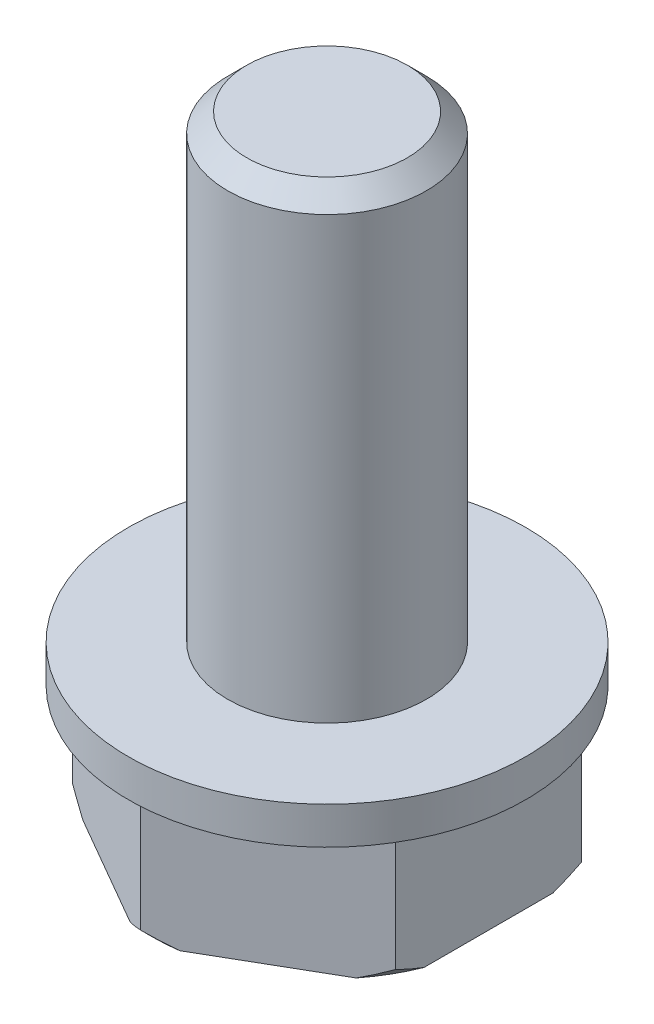
ISO-10303-21;
HEADER;
FILE_DESCRIPTION(('STEP AP214'),'2;1');
FILE_NAME('part.step','',(''),(''),'','','');
FILE_SCHEMA(('AUTOMOTIVE_DESIGN { 1 0 10303 214 1 1 1 1 }'));
ENDSEC;
DATA;
#1=APPLICATION_CONTEXT('core data for automotive mechanical design processes');
#2=APPLICATION_PROTOCOL_DEFINITION('international standard','automotive_design',2000,#1);
#3=PRODUCT_CONTEXT('',#1,'mechanical');
#4=PRODUCT('Part','Part','',(#3));
#5=PRODUCT_RELATED_PRODUCT_CATEGORY('part','',(#4));
#6=PRODUCT_DEFINITION_FORMATION('','',#4);
#7=PRODUCT_DEFINITION_CONTEXT('part definition',#1,'design');
#8=PRODUCT_DEFINITION('design','',#6,#7);
#9=PRODUCT_DEFINITION_SHAPE('','',#8);
#10=(LENGTH_UNIT() NAMED_UNIT(*) SI_UNIT(.MILLI.,.METRE.));
#11=(NAMED_UNIT(*) PLANE_ANGLE_UNIT() SI_UNIT($,.RADIAN.));
#12=(NAMED_UNIT(*) SI_UNIT($,.STERADIAN.) SOLID_ANGLE_UNIT());
#13=UNCERTAINTY_MEASURE_WITH_UNIT(LENGTH_MEASURE(1.E-05),#10,'distance_accuracy_value','');
#14=(GEOMETRIC_REPRESENTATION_CONTEXT(3) GLOBAL_UNCERTAINTY_ASSIGNED_CONTEXT((#13)) GLOBAL_UNIT_ASSIGNED_CONTEXT((#10,
#11,#12)) REPRESENTATION_CONTEXT('',''));
#15=CARTESIAN_POINT('',(0.,0.,0.));
#16=DIRECTION('',(0.,0.,1.));
#17=DIRECTION('',(1.,0.,0.));
#18=AXIS2_PLACEMENT_3D('',#15,#16,#17);
#19=CARTESIAN_POINT('',(-18.2487373415292,113.4,20.9959605917966));
#20=DIRECTION('',(-0.5,0.,0.866025403784439));
#21=DIRECTION('',(0.866025403784439,0.,0.5));
#22=AXIS2_PLACEMENT_3D('',#19,#20,#21);
#23=PLANE('',#22);
#24=DIRECTION('',(0.,-1.,0.));
#25=VECTOR('',#24,1.);
#26=CARTESIAN_POINT('',(-18.2487373415292,113.4,20.9959605917966));
#27=LINE('',#26,#25);
#28=CARTESIAN_POINT('',(-18.2487373415292,68.7,20.9959605917966));
#29=VERTEX_POINT('',#28);
#30=CARTESIAN_POINT('',(-18.2487373415292,63.9055534994651,20.9959605917966));
#31=VERTEX_POINT('',#30);
#32=EDGE_CURVE('E11',#29,#31,#27,.T.);
#33=ORIENTED_EDGE('',*,*,#32,.T.);
#34=CARTESIAN_POINT('',(-19.2487373415292,63.4,20.418610322607));
#35=CARTESIAN_POINT('',(-19.2075875044048,63.4176356350764,20.4423683487996));
#36=CARTESIAN_POINT('',(-19.1665561132061,63.4356367332046,20.466059223998));
#37=CARTESIAN_POINT('',(-19.0843485750121,63.4725093452912,20.5135255035906));
#38=CARTESIAN_POINT('',(-19.0431746303517,63.491387396993,20.5372996452214));
#39=CARTESIAN_POINT('',(-18.9606612245202,63.5300136187559,20.58494289067));
#40=CARTESIAN_POINT('',(-18.9193241287219,63.5497685285904,20.6088106227115));
#41=CARTESIAN_POINT('',(-18.8364645459509,63.5901483001101,20.6566518801523));
#42=CARTESIAN_POINT('',(-18.7949445731156,63.6107800529027,20.6806239409595));
#43=CARTESIAN_POINT('',(-18.7117004687104,63.6529133663717,20.7286845680958));
#44=CARTESIAN_POINT('',(-18.6699789875042,63.6744219220571,20.7527715894061));
#45=CARTESIAN_POINT('',(-18.5863140898282,63.7183087773034,20.8010727907276));
#46=CARTESIAN_POINT('',(-18.5443734460972,63.7406941334488,20.8252853590476));
#47=CARTESIAN_POINT('',(-18.4602534517763,63.7863344571394,20.8738481173586));
#48=CARTESIAN_POINT('',(-18.4180769827817,63.8095965033679,20.8981966416392));
#49=CARTESIAN_POINT('',(-18.3334693927313,63.8569905234084,20.9470416600006));
#50=CARTESIAN_POINT('',(-18.2910412469439,63.8811295690813,20.9715364479081));
#51=CARTESIAN_POINT('',(-18.2487373415292,63.9055534994651,20.9959605917966));
#52=B_SPLINE_CURVE_WITH_KNOTS('',3,(#34,#35,#36,#37,#38,#39,#40,#41,#42,#43,#44,#45,#46,#47,#48,
#49,#50,#51),.UNSPECIFIED.,.F.,.F.,(4,2,2,2,2,2,2,2,4),(0.,0.15204686609259,0.305507708751331,
0.460480357340248,0.617058082843109,0.775329645183755,0.93537936156832,1.0972871929665,
1.26112884592903),.UNSPECIFIED.);
#53=CARTESIAN_POINT('',(-19.2487373415291,63.4,20.4186103226069));
#54=VERTEX_POINT('',#53);
#55=EDGE_CURVE('E259',#54,#31,#52,.T.);
#56=ORIENTED_EDGE('',*,*,#55,.F.);
#57=DIRECTION('',(0.866025403784439,0.,0.5));
#58=VECTOR('',#57,1.);
#59=CARTESIAN_POINT('',(-16.2487373415291,63.4,22.1506611301759));
#60=LINE('',#59,#58);
#61=CARTESIAN_POINT('',(-23.7487373415292,63.4,17.8205341112537));
#62=VERTEX_POINT('',#61);
#63=EDGE_CURVE('E382',#62,#54,#60,.T.);
#64=ORIENTED_EDGE('',*,*,#63,.F.);
#65=CARTESIAN_POINT('',(-24.7487373415292,63.9055534994651,17.243183842064));
#66=CARTESIAN_POINT('',(-24.7064334597487,63.8811295690813,17.2676080268882));
#67=CARTESIAN_POINT('',(-24.6640062782667,63.8569905234084,17.2921044850218));
#68=CARTESIAN_POINT('',(-24.5794014564922,63.8095965033679,17.3409542981778));
#69=CARTESIAN_POINT('',(-24.5372267814232,63.7863344571393,17.3653059296287));
#70=CARTESIAN_POINT('',(-24.4531102018877,63.7406941334488,17.4138746025213));
#71=CARTESIAN_POINT('',(-24.4111711807661,63.7183087773034,17.4380899812835));
#72=CARTESIAN_POINT('',(-24.3275086645504,63.6744219220571,17.4863953074152));
#73=CARTESIAN_POINT('',(-24.2857879515911,63.6529133663717,17.5104836593681));
#74=CARTESIAN_POINT('',(-24.2025441753667,63.6107800529027,17.5585448549301));
#75=CARTESIAN_POINT('',(-24.1610237753089,63.5901483001101,17.5825161757663));
#76=CARTESIAN_POINT('',(-24.0781622396307,63.5497685285904,17.6303540506726));
#77=CARTESIAN_POINT('',(-24.0368236294529,63.5300136187559,17.6542191597318));
#78=CARTESIAN_POINT('',(-23.9543066656599,63.4913873969929,17.7018562426104));
#79=CARTESIAN_POINT('',(-23.9131306827243,63.4725093452912,17.7256268538449));
#80=CARTESIAN_POINT('',(-23.830919909677,63.4356367332046,17.7730875305072));
#81=CARTESIAN_POINT('',(-23.7898873143179,63.4176356350764,17.7967763200387));
#82=CARTESIAN_POINT('',(-23.7487373415292,63.4,17.8205341112537));
#83=B_SPLINE_CURVE_WITH_KNOTS('',3,(#65,#66,#67,#68,#69,#70,#71,#72,#73,#74,#75,#76,#77,#78,#79,
#80,#81,#82),.UNSPECIFIED.,.F.,.F.,(4,2,2,2,2,2,2,2,4),(0.,0.163841652962563,0.32574948436077,
0.485799200745345,0.644070763085999,0.800648488588859,0.955621137177762,1.10908197983649,
1.26112884592904),.UNSPECIFIED.);
#84=CARTESIAN_POINT('',(-24.7487373415292,63.9055534994651,17.243183842064));
#85=VERTEX_POINT('',#84);
#86=EDGE_CURVE('E122',#85,#62,#83,.T.);
#87=ORIENTED_EDGE('',*,*,#86,.F.);
#88=DIRECTION('',(0.,-1.,0.));
#89=VECTOR('',#88,1.);
#90=CARTESIAN_POINT('',(-24.7487373415292,113.4,17.243183842064));
#91=LINE('',#90,#89);
#92=CARTESIAN_POINT('',(-24.7487373415292,68.7,17.243183842064));
#93=VERTEX_POINT('',#92);
#94=EDGE_CURVE('E116',#93,#85,#91,.T.);
#95=ORIENTED_EDGE('',*,*,#94,.F.);
#96=DIRECTION('',(-0.866025403784439,0.,-0.5));
#97=VECTOR('',#96,1.);
#98=CARTESIAN_POINT('',(-18.4987373415292,68.7,20.8516230244992));
#99=LINE('',#98,#97);
#100=EDGE_CURVE('E119',#29,#93,#99,.T.);
#101=ORIENTED_EDGE('',*,*,#100,.F.);
#102=EDGE_LOOP('',(#33,#56,#64,#87,#95,#101));
#103=FACE_BOUND('',#102,.T.);
#104=ADVANCED_FACE('F16',(#103),#23,.F.);
#105=CARTESIAN_POINT('',(-18.2487373415292,113.4,28.5015140912618));
#106=DIRECTION('',(-1.,0.,0.));
#107=DIRECTION('',(0.,0.,1.));
#108=AXIS2_PLACEMENT_3D('',#105,#106,#107);
#109=PLANE('',#108);
#110=DIRECTION('',(0.,-1.,0.));
#111=VECTOR('',#110,1.);
#112=CARTESIAN_POINT('',(-18.2487373415292,113.4,28.5015140912618));
#113=LINE('',#112,#111);
#114=CARTESIAN_POINT('',(-18.2487373415292,68.7,28.5015140912618));
#115=VERTEX_POINT('',#114);
#116=CARTESIAN_POINT('',(-18.2487373415292,63.9055534994651,28.5015140912618));
#117=VERTEX_POINT('',#116);
#118=EDGE_CURVE('E156',#115,#117,#113,.T.);
#119=ORIENTED_EDGE('',*,*,#118,.T.);
#120=CARTESIAN_POINT('',(-18.2487373415292,63.4,27.3468135528825));
#121=CARTESIAN_POINT('',(-18.2487374771936,63.4176356350764,27.39432937029));
#122=CARTESIAN_POINT('',(-18.248738681354,63.4356367332046,27.4417090350199));
#123=CARTESIAN_POINT('',(-18.2487419162073,63.4725093452912,27.5366359912749));
#124=CARTESIAN_POINT('',(-18.2487439544825,63.4913873969929,27.5841807441401));
#125=CARTESIAN_POINT('',(-18.2487475124439,63.5300136187559,27.6794610724673));
#126=CARTESIAN_POINT('',(-18.2487490268234,63.5497685285904,27.727193913568));
#127=CARTESIAN_POINT('',(-18.2487509797307,63.5901483001101,27.8228730459151));
#128=CARTESIAN_POINT('',(-18.2487514069532,63.6107800529027,27.8708164275585));
#129=CARTESIAN_POINT('',(-18.2487510787723,63.6529133663717,27.9669382502568));
#130=CARTESIAN_POINT('',(-18.2487503105256,63.674421922057,28.01511362352));
#131=CARTESIAN_POINT('',(-18.2487479290653,63.7183087773034,28.1117201509732));
#132=CARTESIAN_POINT('',(-18.2487463064557,63.7406941334488,28.1601480980554));
#133=CARTESIAN_POINT('',(-18.2487428916704,63.7863344571393,28.2572795292589));
#134=CARTESIAN_POINT('',(-18.2487410977448,63.8095965033679,28.3059796849905));
#135=CARTESIAN_POINT('',(-18.2487383294689,63.8569905234084,28.4036745165079));
#136=CARTESIAN_POINT('',(-18.2487373651634,63.8811295690813,28.452665762549));
#137=CARTESIAN_POINT('',(-18.2487373415292,63.9055534994651,28.5015140912617));
#138=B_SPLINE_CURVE_WITH_KNOTS('',3,(#120,#121,#122,#123,#124,#125,#126,#127,#128,#129,#130,
#131,#132,#133,#134,#135,#136,#137),.UNSPECIFIED.,.F.,.F.,(4,2,2,2,2,2,2,2,4),(0.,
0.152046866092561,0.305507708751281,0.460480357340183,0.617058082843045,0.775329645183697,
0.935379361568268,1.09728719296647,1.26112884592903),.UNSPECIFIED.);
#139=CARTESIAN_POINT('',(-18.2487373415292,63.4,27.3468135528825));
#140=VERTEX_POINT('',#139);
#141=EDGE_CURVE('E29',#140,#117,#138,.T.);
#142=ORIENTED_EDGE('',*,*,#141,.F.);
#143=DIRECTION('',(0.,0.,1.));
#144=VECTOR('',#143,1.);
#145=CARTESIAN_POINT('',(-18.2487373415292,63.4,24.7487373415292));
#146=LINE('',#145,#144);
#147=CARTESIAN_POINT('',(-18.2487373415292,63.4,22.1506611301759));
#148=VERTEX_POINT('',#147);
#149=EDGE_CURVE('E244',#148,#140,#146,.T.);
#150=ORIENTED_EDGE('',*,*,#149,.F.);
#151=CARTESIAN_POINT('',(-18.2487373415292,63.9055534994651,20.9959605917966));
#152=CARTESIAN_POINT('',(-18.2487373415292,63.7175987189877,21.3718701527514));
#153=CARTESIAN_POINT('',(-18.2487373415292,63.5456736196058,21.7581725138741));
#154=CARTESIAN_POINT('',(-18.2487373415292,63.4,22.1506611301759));
#155=(BOUNDED_CURVE() B_SPLINE_CURVE(3,(#151,#152,#153,#154),.UNSPECIFIED.,.F.,
.F.) B_SPLINE_CURVE_WITH_KNOTS((4,4),(0.00544471025563386,0.00669711306648936),
.UNSPECIFIED.) CURVE() GEOMETRIC_REPRESENTATION_ITEM() RATIONAL_B_SPLINE_CURVE((1.,1.,1.,1.)) REPRESENTATION_ITEM(''));
#156=EDGE_CURVE('E495',#31,#148,#155,.T.);
#157=ORIENTED_EDGE('',*,*,#156,.F.);
#158=ORIENTED_EDGE('',*,*,#32,.F.);
#159=DIRECTION('',(0.,0.,-1.));
#160=VECTOR('',#159,1.);
#161=CARTESIAN_POINT('',(-18.2487373415292,68.7,24.7487373415292));
#162=LINE('',#161,#160);
#163=EDGE_CURVE('E140',#115,#29,#162,.T.);
#164=ORIENTED_EDGE('',*,*,#163,.F.);
#165=EDGE_LOOP('',(#119,#142,#150,#157,#158,#164));
#166=FACE_BOUND('',#165,.T.);
#167=ADVANCED_FACE('F185',(#166),#109,.F.);
#168=CARTESIAN_POINT('',(-24.7487373415292,64.2,24.7487373415292));
#169=DIRECTION('',(0.,1.,0.));
#170=DIRECTION('',(0.,0.,1.));
#171=AXIS2_PLACEMENT_3D('',#168,#169,#170);
#172=CONICAL_SURFACE('',#171,7.8,0.785398163397448);
#173=CARTESIAN_POINT('',(-24.7487373415292,63.4,24.7487373415292));
#174=DIRECTION('',(0.,-1.,0.));
#175=DIRECTION('',(0.,0.,-1.));
#176=AXIS2_PLACEMENT_3D('',#173,#174,#175);
#177=CIRCLE('',#176,7.);
#178=CARTESIAN_POINT('',(-19.2487373415291,63.4,29.0788643604513));
#179=VERTEX_POINT('',#178);
#180=EDGE_CURVE('E236',#140,#179,#177,.T.);
#181=ORIENTED_EDGE('',*,*,#180,.F.);
#182=ORIENTED_EDGE('',*,*,#141,.T.);
#183=CARTESIAN_POINT('',(-18.2487373415292,63.9055534994651,28.5015140912617));
#184=CARTESIAN_POINT('',(-18.2910412469439,63.8811295690813,28.5259382351502));
#185=CARTESIAN_POINT('',(-18.3334693927313,63.8569905234084,28.5504330230578));
#186=CARTESIAN_POINT('',(-18.4180769827818,63.8095965033679,28.5992780414191));
#187=CARTESIAN_POINT('',(-18.4602534517764,63.7863344571393,28.6236265656998));
#188=CARTESIAN_POINT('',(-18.5443734460972,63.7406941334488,28.6721893240107));
#189=CARTESIAN_POINT('',(-18.5863140898283,63.7183087773034,28.6964018923307));
#190=CARTESIAN_POINT('',(-18.6699789875043,63.674421922057,28.7447030936522));
#191=CARTESIAN_POINT('',(-18.7117004687104,63.6529133663717,28.7687901149626));
#192=CARTESIAN_POINT('',(-18.7949445731156,63.6107800529026,28.8168507420988));
#193=CARTESIAN_POINT('',(-18.8364645459509,63.5901483001101,28.8408228029061));
#194=CARTESIAN_POINT('',(-18.919324128722,63.5497685285904,28.8886640603469));
#195=CARTESIAN_POINT('',(-18.9606612245202,63.5300136187559,28.9125317923884));
#196=CARTESIAN_POINT('',(-19.0431746303517,63.4913873969929,28.9601750378369));
#197=CARTESIAN_POINT('',(-19.0843485750121,63.4725093452911,28.9839491794677));
#198=CARTESIAN_POINT('',(-19.1665561132061,63.4356367332046,29.0314154590603));
#199=CARTESIAN_POINT('',(-19.2075875044049,63.4176356350764,29.0551063342587));
#200=CARTESIAN_POINT('',(-19.2487373415292,63.4,29.0788643604513));
#201=B_SPLINE_CURVE_WITH_KNOTS('',3,(#183,#184,#185,#186,#187,#188,#189,#190,#191,#192,#193,
#194,#195,#196,#197,#198,#199,#200),.UNSPECIFIED.,.F.,.F.,(4,2,2,2,2,2,2,2,4),(0.,
0.163841652962564,0.325749484360772,0.485799200745345,0.644070763086003,0.800648488588855,
0.955621137177764,1.10908197983648,1.26112884592904),.UNSPECIFIED.);
#202=EDGE_CURVE('E207',#117,#179,#201,.T.);
#203=ORIENTED_EDGE('',*,*,#202,.T.);
#204=EDGE_LOOP('',(#181,#182,#203));
#205=FACE_BOUND('',#204,.T.);
#206=ADVANCED_FACE('F175',(#205),#172,.T.);
#207=CARTESIAN_POINT('',(-24.7487373415292,64.2,24.7487373415292));
#208=DIRECTION('',(0.,1.,0.));
#209=DIRECTION('',(0.,0.,1.));
#210=AXIS2_PLACEMENT_3D('',#207,#208,#209);
#211=CONICAL_SURFACE('',#210,7.8,0.785398163397448);
#212=CARTESIAN_POINT('',(-24.7487373415292,63.4,24.7487373415292));
#213=DIRECTION('',(0.,-1.,0.));
#214=DIRECTION('',(0.,0.,-1.));
#215=AXIS2_PLACEMENT_3D('',#212,#213,#214);
#216=CIRCLE('',#215,7.);
#217=EDGE_CURVE('E249',#54,#148,#216,.T.);
#218=ORIENTED_EDGE('',*,*,#217,.F.);
#219=ORIENTED_EDGE('',*,*,#55,.T.);
#220=ORIENTED_EDGE('',*,*,#156,.T.);
#221=EDGE_LOOP('',(#218,#219,#220));
#222=FACE_BOUND('',#221,.T.);
#223=ADVANCED_FACE('F184',(#222),#211,.T.);
#224=CARTESIAN_POINT('',(-24.7487373415292,64.2,24.7487373415292));
#225=DIRECTION('',(0.,1.,0.));
#226=DIRECTION('',(0.,0.,1.));
#227=AXIS2_PLACEMENT_3D('',#224,#225,#226);
#228=CONICAL_SURFACE('',#227,7.8,0.785398163397448);
#229=CARTESIAN_POINT('',(-24.7487373415292,63.4,24.7487373415292));
#230=DIRECTION('',(0.,-1.,0.));
#231=DIRECTION('',(0.,0.,-1.));
#232=AXIS2_PLACEMENT_3D('',#229,#230,#231);
#233=CIRCLE('',#232,7.);
#234=CARTESIAN_POINT('',(-25.7487373415292,63.4,17.8205341112537));
#235=VERTEX_POINT('',#234);
#236=EDGE_CURVE('E346',#235,#62,#233,.T.);
#237=ORIENTED_EDGE('',*,*,#236,.F.);
#238=CARTESIAN_POINT('',(-25.7487373415292,63.4,17.8205341112537));
#239=CARTESIAN_POINT('',(-25.7075873687404,63.4176356350764,17.7967763200387));
#240=CARTESIAN_POINT('',(-25.6665547733813,63.4356367332046,17.7730875305072));
#241=CARTESIAN_POINT('',(-25.5843440003339,63.4725093452912,17.7256268538449));
#242=CARTESIAN_POINT('',(-25.5431680173983,63.491387396993,17.7018562426104));
#243=CARTESIAN_POINT('',(-25.4606510536054,63.5300136187559,17.6542191597318));
#244=CARTESIAN_POINT('',(-25.4193124434276,63.5497685285904,17.6303540506726));
#245=CARTESIAN_POINT('',(-25.3364509077493,63.5901483001101,17.5825161757663));
#246=CARTESIAN_POINT('',(-25.2949305076916,63.6107800529027,17.5585448549301));
#247=CARTESIAN_POINT('',(-25.2116867314672,63.6529133663717,17.510483659368));
#248=CARTESIAN_POINT('',(-25.1699660185078,63.6744219220571,17.4863953074152));
#249=CARTESIAN_POINT('',(-25.0863035022921,63.7183087773034,17.4380899812835));
#250=CARTESIAN_POINT('',(-25.0443644811706,63.7406941334488,17.4138746025213));
#251=CARTESIAN_POINT('',(-24.9602479016351,63.7863344571394,17.3653059296287));
#252=CARTESIAN_POINT('',(-24.9180732265661,63.8095965033679,17.3409542981778));
#253=CARTESIAN_POINT('',(-24.8334684047915,63.8569905234084,17.2921044850218));
#254=CARTESIAN_POINT('',(-24.7910412233096,63.8811295690813,17.2676080268882));
#255=CARTESIAN_POINT('',(-24.7487373415291,63.9055534994651,17.243183842064));
#256=B_SPLINE_CURVE_WITH_KNOTS('',3,(#238,#239,#240,#241,#242,#243,#244,#245,#246,#247,#248,
#249,#250,#251,#252,#253,#254,#255),.UNSPECIFIED.,.F.,.F.,(4,2,2,2,2,2,2,2,4),(0.,
0.152046866092592,0.305507708751337,0.460480357340255,0.617058082843122,0.775329645183774,
0.93537936156834,1.09728719296653,1.26112884592906),.UNSPECIFIED.);
#257=EDGE_CURVE('E126',#235,#85,#256,.T.);
#258=ORIENTED_EDGE('',*,*,#257,.T.);
#259=ORIENTED_EDGE('',*,*,#86,.T.);
#260=EDGE_LOOP('',(#237,#258,#259));
#261=FACE_BOUND('',#260,.T.);
#262=ADVANCED_FACE('F272',(#261),#228,.T.);
#263=CARTESIAN_POINT('',(-24.7487373415292,70.2,24.7487373415292));
#264=DIRECTION('',(0.,-1.,0.));
#265=DIRECTION('',(0.,0.,-1.));
#266=AXIS2_PLACEMENT_3D('',#263,#264,#265);
#267=PLANE('',#266);
#268=CARTESIAN_POINT('',(-24.7487373415292,70.2,24.7487373415292));
#269=DIRECTION('',(0.,-1.,0.));
#270=DIRECTION('',(0.,0.,-1.));
#271=AXIS2_PLACEMENT_3D('',#268,#269,#270);
#272=CIRCLE('',#271,4.);
#273=CARTESIAN_POINT('',(-24.7487373415292,70.2,20.7487373415292));
#274=VERTEX_POINT('',#273);
#275=EDGE_CURVE('E148',#274,#274,#272,.T.);
#276=ORIENTED_EDGE('',*,*,#275,.T.);
#277=EDGE_LOOP('',(#276));
#278=FACE_BOUND('',#277,.T.);
#279=CARTESIAN_POINT('',(-24.7487373415292,70.2,24.7487373415292));
#280=DIRECTION('',(0.,-1.,0.));
#281=DIRECTION('',(0.,0.,-1.));
#282=AXIS2_PLACEMENT_3D('',#279,#280,#281);
#283=CIRCLE('',#282,8.);
#284=CARTESIAN_POINT('',(-24.7487373415292,70.2,16.7487373415292));
#285=VERTEX_POINT('',#284);
#286=EDGE_CURVE('E151',#285,#285,#283,.T.);
#287=ORIENTED_EDGE('',*,*,#286,.F.);
#288=EDGE_LOOP('',(#287));
#289=FACE_BOUND('',#288,.T.);
#290=ADVANCED_FACE('F278',(#278,#289),#267,.F.);
#291=CARTESIAN_POINT('',(-24.7487373415292,64.2,24.7487373415292));
#292=DIRECTION('',(0.,1.,0.));
#293=DIRECTION('',(0.,0.,1.));
#294=AXIS2_PLACEMENT_3D('',#291,#292,#293);
#295=CONICAL_SURFACE('',#294,7.8,0.785398163397448);
#296=CARTESIAN_POINT('',(-24.7487373415292,63.4,24.7487373415292));
#297=DIRECTION('',(0.,-1.,0.));
#298=DIRECTION('',(0.,0.,-1.));
#299=AXIS2_PLACEMENT_3D('',#296,#297,#298);
#300=CIRCLE('',#299,7.);
#301=CARTESIAN_POINT('',(-31.2487373415292,63.4,22.1506611301759));
#302=VERTEX_POINT('',#301);
#303=CARTESIAN_POINT('',(-30.2487373415292,63.4,20.4186103226069));
#304=VERTEX_POINT('',#303);
#305=EDGE_CURVE('E387',#302,#304,#300,.T.);
#306=ORIENTED_EDGE('',*,*,#305,.F.);
#307=CARTESIAN_POINT('',(-31.2487373415291,63.4,22.1506611301758));
#308=CARTESIAN_POINT('',(-31.2487372058647,63.4176356350764,22.1031453127683));
#309=CARTESIAN_POINT('',(-31.2487360017043,63.4356367332046,22.0557656480384));
#310=CARTESIAN_POINT('',(-31.248732766851,63.4725093452911,21.9608386917835));
#311=CARTESIAN_POINT('',(-31.2487307285758,63.4913873969929,21.9132939389182));
#312=CARTESIAN_POINT('',(-31.2487271706144,63.5300136187559,21.8180136105911));
#313=CARTESIAN_POINT('',(-31.2487256562349,63.5497685285904,21.7702807694904));
#314=CARTESIAN_POINT('',(-31.2487237033276,63.59014830011,21.6746016371432));
#315=CARTESIAN_POINT('',(-31.2487232761051,63.6107800529026,21.6266582554998));
#316=CARTESIAN_POINT('',(-31.248723604286,63.6529133663716,21.5305364328015));
#317=CARTESIAN_POINT('',(-31.2487243725327,63.674421922057,21.4823610595383));
#318=CARTESIAN_POINT('',(-31.248726753993,63.7183087773034,21.3857545320851));
#319=CARTESIAN_POINT('',(-31.2487283766026,63.7406941334487,21.3373265850029));
#320=CARTESIAN_POINT('',(-31.2487317913879,63.7863344571393,21.2401951537994));
#321=CARTESIAN_POINT('',(-31.2487335853135,63.8095965033679,21.1914949980678));
#322=CARTESIAN_POINT('',(-31.2487363535894,63.8569905234084,21.0938001665504));
#323=CARTESIAN_POINT('',(-31.2487373178949,63.8811295690813,21.0448089205093));
#324=CARTESIAN_POINT('',(-31.2487373415291,63.9055534994651,20.9959605917966));
#325=B_SPLINE_CURVE_WITH_KNOTS('',3,(#307,#308,#309,#310,#311,#312,#313,#314,#315,#316,#317,
#318,#319,#320,#321,#322,#323,#324),.UNSPECIFIED.,.F.,.F.,(4,2,2,2,2,2,2,2,4),(0.,
0.152046866092541,0.30550770875124,0.460480357340139,0.617058082842995,0.775329645183659,
0.935379361568239,1.09728719296646,1.26112884592905),.UNSPECIFIED.);
#326=CARTESIAN_POINT('',(-31.2487373415292,63.9055534994651,20.9959605917966));
#327=VERTEX_POINT('',#326);
#328=EDGE_CURVE('E127',#302,#327,#325,.T.);
#329=ORIENTED_EDGE('',*,*,#328,.T.);
#330=CARTESIAN_POINT('',(-31.2487373415291,63.9055534994651,20.9959605917966));
#331=CARTESIAN_POINT('',(-31.2064334361144,63.8811295690813,20.9715364479081));
#332=CARTESIAN_POINT('',(-31.164005290327,63.8569905234084,20.9470416600005));
#333=CARTESIAN_POINT('',(-31.0793977002765,63.8095965033679,20.8981966416391));
#334=CARTESIAN_POINT('',(-31.0372212312819,63.7863344571393,20.8738481173585));
#335=CARTESIAN_POINT('',(-30.9531012369611,63.7406941334488,20.8252853590475));
#336=CARTESIAN_POINT('',(-30.91116059323,63.7183087773034,20.8010727907276));
#337=CARTESIAN_POINT('',(-30.827495695554,63.674421922057,20.7527715894061));
#338=CARTESIAN_POINT('',(-30.7857742143479,63.6529133663717,20.7286845680957));
#339=CARTESIAN_POINT('',(-30.7025301099427,63.6107800529026,20.6806239409595));
#340=CARTESIAN_POINT('',(-30.6610101371074,63.5901483001101,20.6566518801522));
#341=CARTESIAN_POINT('',(-30.5781505543363,63.5497685285904,20.6088106227114));
#342=CARTESIAN_POINT('',(-30.5368134585381,63.5300136187559,20.5849428906699));
#343=CARTESIAN_POINT('',(-30.4543000527066,63.4913873969929,20.5372996452214));
#344=CARTESIAN_POINT('',(-30.4131261080462,63.4725093452911,20.5135255035906));
#345=CARTESIAN_POINT('',(-30.3309185698522,63.4356367332046,20.466059223998));
#346=CARTESIAN_POINT('',(-30.2898871786534,63.4176356350764,20.4423683487996));
#347=CARTESIAN_POINT('',(-30.2487373415291,63.4,20.418610322607));
#348=B_SPLINE_CURVE_WITH_KNOTS('',3,(#330,#331,#332,#333,#334,#335,#336,#337,#338,#339,#340,
#341,#342,#343,#344,#345,#346,#347),.UNSPECIFIED.,.F.,.F.,(4,2,2,2,2,2,2,2,4),(0.,
0.163841652962561,0.325749484360773,0.485799200745349,0.644070763086004,0.80064848858886,
0.955621137177767,1.10908197983648,1.26112884592904),.UNSPECIFIED.);
#349=EDGE_CURVE('E153',#327,#304,#348,.T.);
#350=ORIENTED_EDGE('',*,*,#349,.T.);
#351=EDGE_LOOP('',(#306,#329,#350));
#352=FACE_BOUND('',#351,.T.);
#353=ADVANCED_FACE('F276',(#352),#295,.T.);
#354=CARTESIAN_POINT('',(-24.7487373415292,68.7,24.7487373415292));
#355=DIRECTION('',(0.,-1.,0.));
#356=DIRECTION('',(0.,0.,-1.));
#357=AXIS2_PLACEMENT_3D('',#354,#355,#356);
#358=CYLINDRICAL_SURFACE('',#357,8.);
#359=ORIENTED_EDGE('',*,*,#286,.T.);
#360=EDGE_LOOP('',(#359));
#361=FACE_BOUND('',#360,.T.);
#362=CARTESIAN_POINT('',(-24.7487373415292,68.7,24.7487373415292));
#363=DIRECTION('',(0.,-1.,0.));
#364=DIRECTION('',(0.,0.,-1.));
#365=AXIS2_PLACEMENT_3D('',#362,#363,#364);
#366=CIRCLE('',#365,8.);
#367=CARTESIAN_POINT('',(-24.7487373415292,68.7,16.7487373415292));
#368=VERTEX_POINT('',#367);
#369=EDGE_CURVE('E159',#368,#368,#366,.T.);
#370=ORIENTED_EDGE('',*,*,#369,.F.);
#371=EDGE_LOOP('',(#370));
#372=FACE_BOUND('',#371,.T.);
#373=ADVANCED_FACE('F273',(#361,#372),#358,.T.);
#374=CARTESIAN_POINT('',(-24.7487373415292,113.4,17.243183842064));
#375=DIRECTION('',(0.5,0.,0.866025403784439));
#376=DIRECTION('',(0.866025403784439,0.,-0.5));
#377=AXIS2_PLACEMENT_3D('',#374,#375,#376);
#378=PLANE('',#377);
#379=ORIENTED_EDGE('',*,*,#94,.T.);
#380=ORIENTED_EDGE('',*,*,#257,.F.);
#381=DIRECTION('',(0.866025403784439,0.,-0.5));
#382=VECTOR('',#381,1.);
#383=CARTESIAN_POINT('',(-22.7487373415292,63.4,16.0884833036848));
#384=LINE('',#383,#382);
#385=EDGE_CURVE('E339',#304,#235,#384,.T.);
#386=ORIENTED_EDGE('',*,*,#385,.F.);
#387=ORIENTED_EDGE('',*,*,#349,.F.);
#388=DIRECTION('',(0.,-1.,0.));
#389=VECTOR('',#388,1.);
#390=CARTESIAN_POINT('',(-31.2487373415292,113.4,20.9959605917966));
#391=LINE('',#390,#389);
#392=CARTESIAN_POINT('',(-31.2487373415292,68.7,20.9959605917966));
#393=VERTEX_POINT('',#392);
#394=EDGE_CURVE('E133',#393,#327,#391,.T.);
#395=ORIENTED_EDGE('',*,*,#394,.F.);
#396=DIRECTION('',(-0.866025403784439,0.,0.5));
#397=VECTOR('',#396,1.);
#398=CARTESIAN_POINT('',(-24.9987373415292,68.7,17.3875214093615));
#399=LINE('',#398,#397);
#400=EDGE_CURVE('E130',#93,#393,#399,.T.);
#401=ORIENTED_EDGE('',*,*,#400,.F.);
#402=EDGE_LOOP('',(#379,#380,#386,#387,#395,#401));
#403=FACE_BOUND('',#402,.T.);
#404=ADVANCED_FACE('F131',(#403),#378,.F.);
#405=CARTESIAN_POINT('',(-31.2487373415292,113.4,20.9959605917966));
#406=DIRECTION('',(1.,0.,0.));
#407=DIRECTION('',(0.,0.,-1.));
#408=AXIS2_PLACEMENT_3D('',#405,#406,#407);
#409=PLANE('',#408);
#410=ORIENTED_EDGE('',*,*,#394,.T.);
#411=ORIENTED_EDGE('',*,*,#328,.F.);
#412=DIRECTION('',(0.,0.,-1.));
#413=VECTOR('',#412,1.);
#414=CARTESIAN_POINT('',(-31.2487373415292,63.4,24.7487373415292));
#415=LINE('',#414,#413);
#416=CARTESIAN_POINT('',(-31.2487373415292,63.4,27.3468135528825));
#417=VERTEX_POINT('',#416);
#418=EDGE_CURVE('E389',#417,#302,#415,.T.);
#419=ORIENTED_EDGE('',*,*,#418,.F.);
#420=CARTESIAN_POINT('',(-31.2487373415292,63.9055534994651,28.5015140912618));
#421=CARTESIAN_POINT('',(-31.2487373415292,63.7175987189877,28.125604530307));
#422=CARTESIAN_POINT('',(-31.2487373415292,63.5456736196058,27.7393021691841));
#423=CARTESIAN_POINT('',(-31.2487373415292,63.4,27.3468135528825));
#424=(BOUNDED_CURVE() B_SPLINE_CURVE(3,(#420,#421,#422,#423),.UNSPECIFIED.,.F.,
.F.) B_SPLINE_CURVE_WITH_KNOTS((4,4),(0.00544471025563386,0.00669711306648936),
.UNSPECIFIED.) CURVE() GEOMETRIC_REPRESENTATION_ITEM() RATIONAL_B_SPLINE_CURVE((1.,1.,1.,1.)) REPRESENTATION_ITEM(''));
#425=CARTESIAN_POINT('',(-31.2487373415292,63.9055534994651,28.5015140912618));
#426=VERTEX_POINT('',#425);
#427=EDGE_CURVE('E150',#426,#417,#424,.T.);
#428=ORIENTED_EDGE('',*,*,#427,.F.);
#429=DIRECTION('',(0.,-1.,0.));
#430=VECTOR('',#429,1.);
#431=CARTESIAN_POINT('',(-31.2487373415292,113.4,28.5015140912618));
#432=LINE('',#431,#430);
#433=CARTESIAN_POINT('',(-31.2487373415292,68.7,28.5015140912618));
#434=VERTEX_POINT('',#433);
#435=EDGE_CURVE('E155',#434,#426,#432,.T.);
#436=ORIENTED_EDGE('',*,*,#435,.F.);
#437=DIRECTION('',(0.,0.,1.));
#438=VECTOR('',#437,1.);
#439=CARTESIAN_POINT('',(-31.2487373415292,68.7,24.7487373415292));
#440=LINE('',#439,#438);
#441=EDGE_CURVE('E136',#393,#434,#440,.T.);
#442=ORIENTED_EDGE('',*,*,#441,.F.);
#443=EDGE_LOOP('',(#410,#411,#419,#428,#436,#442));
#444=FACE_BOUND('',#443,.T.);
#445=ADVANCED_FACE('F188',(#444),#409,.F.);
#446=CARTESIAN_POINT('',(-16.7487373415292,68.7,24.7487373415292));
#447=DIRECTION('',(0.,1.,0.));
#448=DIRECTION('',(0.,0.,1.));
#449=AXIS2_PLACEMENT_3D('',#446,#447,#448);
#450=PLANE('',#449);
#451=ORIENTED_EDGE('',*,*,#369,.T.);
#452=EDGE_LOOP('',(#451));
#453=FACE_BOUND('',#452,.T.);
#454=ORIENTED_EDGE('',*,*,#163,.T.);
#455=ORIENTED_EDGE('',*,*,#100,.T.);
#456=ORIENTED_EDGE('',*,*,#400,.T.);
#457=ORIENTED_EDGE('',*,*,#441,.T.);
#458=DIRECTION('',(0.866025403784439,0.,0.5));
#459=VECTOR('',#458,1.);
#460=CARTESIAN_POINT('',(-24.9987373415292,68.7,32.1099532736969));
#461=LINE('',#460,#459);
#462=CARTESIAN_POINT('',(-24.7487373415292,68.7,32.2542908409943));
#463=VERTEX_POINT('',#462);
#464=EDGE_CURVE('E160',#434,#463,#461,.T.);
#465=ORIENTED_EDGE('',*,*,#464,.T.);
#466=DIRECTION('',(0.866025403784439,0.,-0.5));
#467=VECTOR('',#466,1.);
#468=CARTESIAN_POINT('',(-18.4987373415292,68.7,28.6458516585592));
#469=LINE('',#468,#467);
#470=EDGE_CURVE('E154',#463,#115,#469,.T.);
#471=ORIENTED_EDGE('',*,*,#470,.T.);
#472=EDGE_LOOP('',(#454,#455,#456,#457,#465,#471));
#473=FACE_BOUND('',#472,.T.);
#474=ADVANCED_FACE('F138',(#453,#473),#450,.F.);
#475=CARTESIAN_POINT('',(-24.7487373415292,88.7,24.7487373415292));
#476=DIRECTION('',(0.,-1.,0.));
#477=DIRECTION('',(0.,0.,-1.));
#478=AXIS2_PLACEMENT_3D('',#475,#476,#477);
#479=CONICAL_SURFACE('',#478,3.233,0.78539816339745);
#480=CARTESIAN_POINT('',(-24.7487373415292,88.7,24.7487373415292));
#481=DIRECTION('',(0.,-1.,0.));
#482=DIRECTION('',(0.,0.,-1.));
#483=AXIS2_PLACEMENT_3D('',#480,#481,#482);
#484=CIRCLE('',#483,3.233);
#485=CARTESIAN_POINT('',(-24.7487373415292,88.7,21.5157373415292));
#486=VERTEX_POINT('',#485);
#487=EDGE_CURVE('E142',#486,#486,#484,.T.);
#488=ORIENTED_EDGE('',*,*,#487,.T.);
#489=EDGE_LOOP('',(#488));
#490=FACE_BOUND('',#489,.T.);
#491=CARTESIAN_POINT('',(-24.7487373415292,87.933,24.7487373415292));
#492=DIRECTION('',(0.,-1.,0.));
#493=DIRECTION('',(0.,0.,-1.));
#494=AXIS2_PLACEMENT_3D('',#491,#492,#493);
#495=CIRCLE('',#494,4.);
#496=CARTESIAN_POINT('',(-24.7487373415292,87.933,20.7487373415292));
#497=VERTEX_POINT('',#496);
#498=EDGE_CURVE('E146',#497,#497,#495,.T.);
#499=ORIENTED_EDGE('',*,*,#498,.F.);
#500=EDGE_LOOP('',(#499));
#501=FACE_BOUND('',#500,.T.);
#502=ADVANCED_FACE('F231',(#490,#501),#479,.T.);
#503=CARTESIAN_POINT('',(-24.7487373415292,88.7,24.7487373415292));
#504=DIRECTION('',(0.,-1.,0.));
#505=DIRECTION('',(0.,0.,-1.));
#506=AXIS2_PLACEMENT_3D('',#503,#504,#505);
#507=PLANE('',#506);
#508=ORIENTED_EDGE('',*,*,#487,.F.);
#509=EDGE_LOOP('',(#508));
#510=FACE_BOUND('',#509,.T.);
#511=ADVANCED_FACE('F286',(#510),#507,.F.);
#512=CARTESIAN_POINT('',(-24.7487373415292,63.4,24.7487373415292));
#513=DIRECTION('',(0.,-1.,0.));
#514=DIRECTION('',(0.,0.,-1.));
#515=AXIS2_PLACEMENT_3D('',#512,#513,#514);
#516=CYLINDRICAL_SURFACE('',#515,4.);
#517=ORIENTED_EDGE('',*,*,#498,.T.);
#518=EDGE_LOOP('',(#517));
#519=FACE_BOUND('',#518,.T.);
#520=ORIENTED_EDGE('',*,*,#275,.F.);
#521=EDGE_LOOP('',(#520));
#522=FACE_BOUND('',#521,.T.);
#523=ADVANCED_FACE('F282',(#519,#522),#516,.T.);
#524=CARTESIAN_POINT('',(-24.7487373415292,64.2,24.7487373415292));
#525=DIRECTION('',(0.,1.,0.));
#526=DIRECTION('',(0.,0.,1.));
#527=AXIS2_PLACEMENT_3D('',#524,#525,#526);
#528=CONICAL_SURFACE('',#527,7.8,0.785398163397448);
#529=CARTESIAN_POINT('',(-24.7487373415292,63.4,24.7487373415292));
#530=DIRECTION('',(0.,-1.,0.));
#531=DIRECTION('',(0.,0.,-1.));
#532=AXIS2_PLACEMENT_3D('',#529,#530,#531);
#533=CIRCLE('',#532,7.);
#534=CARTESIAN_POINT('',(-23.7487373415292,63.4,31.6769405718047));
#535=VERTEX_POINT('',#534);
#536=CARTESIAN_POINT('',(-25.7487373415292,63.4,31.6769405718047));
#537=VERTEX_POINT('',#536);
#538=EDGE_CURVE('E243',#535,#537,#533,.T.);
#539=ORIENTED_EDGE('',*,*,#538,.F.);
#540=CARTESIAN_POINT('',(-23.7487373415292,63.4,31.6769405718047));
#541=CARTESIAN_POINT('',(-23.7898873143179,63.4176356350764,31.7006983630196));
#542=CARTESIAN_POINT('',(-23.830919909677,63.4356367332046,31.7243871525511));
#543=CARTESIAN_POINT('',(-23.9131306827243,63.4725093452912,31.7718478292134));
#544=CARTESIAN_POINT('',(-23.9543066656599,63.4913873969929,31.7956184404479));
#545=CARTESIAN_POINT('',(-24.0368236294528,63.5300136187559,31.8432555233265));
#546=CARTESIAN_POINT('',(-24.0781622396307,63.5497685285904,31.8671206323857));
#547=CARTESIAN_POINT('',(-24.1610237753089,63.5901483001101,31.914958507292));
#548=CARTESIAN_POINT('',(-24.2025441753667,63.6107800529027,31.9389298281282));
#549=CARTESIAN_POINT('',(-24.2857879515911,63.6529133663717,31.9869910236902));
#550=CARTESIAN_POINT('',(-24.3275086645504,63.674421922057,32.0110793756431));
#551=CARTESIAN_POINT('',(-24.4111711807661,63.7183087773034,32.0593847017748));
#552=CARTESIAN_POINT('',(-24.4531102018877,63.7406941334488,32.083600080537));
#553=CARTESIAN_POINT('',(-24.5372267814232,63.7863344571393,32.1321687534295));
#554=CARTESIAN_POINT('',(-24.5794014564922,63.8095965033679,32.1565203848805));
#555=CARTESIAN_POINT('',(-24.6640062782667,63.8569905234084,32.2053701980365));
#556=CARTESIAN_POINT('',(-24.7064334597487,63.8811295690813,32.2298666561701));
#557=CARTESIAN_POINT('',(-24.7487373415292,63.9055534994651,32.2542908409943));
#558=B_SPLINE_CURVE_WITH_KNOTS('',3,(#540,#541,#542,#543,#544,#545,#546,#547,#548,#549,#550,
#551,#552,#553,#554,#555,#556,#557),.UNSPECIFIED.,.F.,.F.,(4,2,2,2,2,2,2,2,4),(0.,
0.152046866092567,0.305507708751293,0.460480357340197,0.617058082843056,0.775329645183709,
0.935379361568278,1.09728719296647,1.26112884592903),.UNSPECIFIED.);
#559=CARTESIAN_POINT('',(-24.7487373415292,63.9055534994651,32.2542908409943));
#560=VERTEX_POINT('',#559);
#561=EDGE_CURVE('E410',#535,#560,#558,.T.);
#562=ORIENTED_EDGE('',*,*,#561,.T.);
#563=CARTESIAN_POINT('',(-24.7487373415291,63.9055534994651,32.2542908409943));
#564=CARTESIAN_POINT('',(-24.7910412233096,63.8811295690813,32.2298666561701));
#565=CARTESIAN_POINT('',(-24.8334684047916,63.8569905234084,32.2053701980365));
#566=CARTESIAN_POINT('',(-24.9180732265661,63.8095965033679,32.1565203848805));
#567=CARTESIAN_POINT('',(-24.9602479016351,63.7863344571393,32.1321687534296));
#568=CARTESIAN_POINT('',(-25.0443644811706,63.7406941334488,32.083600080537));
#569=CARTESIAN_POINT('',(-25.0863035022921,63.7183087773034,32.0593847017748));
#570=CARTESIAN_POINT('',(-25.1699660185079,63.674421922057,32.0110793756431));
#571=CARTESIAN_POINT('',(-25.2116867314672,63.6529133663717,31.9869910236902));
#572=CARTESIAN_POINT('',(-25.2949305076916,63.6107800529026,31.9389298281282));
#573=CARTESIAN_POINT('',(-25.3364509077494,63.5901483001101,31.914958507292));
#574=CARTESIAN_POINT('',(-25.4193124434277,63.5497685285904,31.8671206323857));
#575=CARTESIAN_POINT('',(-25.4606510536055,63.5300136187559,31.8432555233265));
#576=CARTESIAN_POINT('',(-25.5431680173984,63.4913873969929,31.7956184404479));
#577=CARTESIAN_POINT('',(-25.584344000334,63.4725093452912,31.7718478292134));
#578=CARTESIAN_POINT('',(-25.6665547733813,63.4356367332046,31.7243871525511));
#579=CARTESIAN_POINT('',(-25.7075873687404,63.4176356350764,31.7006983630196));
#580=CARTESIAN_POINT('',(-25.7487373415292,63.4,31.6769405718047));
#581=B_SPLINE_CURVE_WITH_KNOTS('',3,(#563,#564,#565,#566,#567,#568,#569,#570,#571,#572,#573,
#574,#575,#576,#577,#578,#579,#580),.UNSPECIFIED.,.F.,.F.,(4,2,2,2,2,2,2,2,4),(0.,
0.163841652962567,0.325749484360774,0.485799200745356,0.644070763086019,0.800648488588874,
0.955621137177791,1.10908197983651,1.26112884592907),.UNSPECIFIED.);
#582=EDGE_CURVE('E162',#560,#537,#581,.T.);
#583=ORIENTED_EDGE('',*,*,#582,.T.);
#584=EDGE_LOOP('',(#539,#562,#583));
#585=FACE_BOUND('',#584,.T.);
#586=ADVANCED_FACE('F285',(#585),#528,.T.);
#587=CARTESIAN_POINT('',(-24.7487373415292,64.2,24.7487373415292));
#588=DIRECTION('',(0.,1.,0.));
#589=DIRECTION('',(0.,0.,1.));
#590=AXIS2_PLACEMENT_3D('',#587,#588,#589);
#591=CONICAL_SURFACE('',#590,7.8,0.785398163397448);
#592=CARTESIAN_POINT('',(-30.2487373415291,63.4,29.0788643604514));
#593=CARTESIAN_POINT('',(-30.2898871786534,63.4176356350764,29.0551063342587));
#594=CARTESIAN_POINT('',(-30.3309185698522,63.4356367332046,29.0314154590603));
#595=CARTESIAN_POINT('',(-30.4131261080462,63.4725093452912,28.9839491794677));
#596=CARTESIAN_POINT('',(-30.4543000527066,63.491387396993,28.9601750378369));
#597=CARTESIAN_POINT('',(-30.5368134585381,63.5300136187559,28.9125317923884));
#598=CARTESIAN_POINT('',(-30.5781505543364,63.5497685285905,28.8886640603469));
#599=CARTESIAN_POINT('',(-30.6610101371074,63.5901483001101,28.840822802906));
#600=CARTESIAN_POINT('',(-30.7025301099427,63.6107800529027,28.8168507420988));
#601=CARTESIAN_POINT('',(-30.7857742143479,63.6529133663717,28.7687901149626));
#602=CARTESIAN_POINT('',(-30.8274956955541,63.6744219220571,28.7447030936522));
#603=CARTESIAN_POINT('',(-30.91116059323,63.7183087773034,28.6964018923307));
#604=CARTESIAN_POINT('',(-30.9531012369611,63.7406941334488,28.6721893240107));
#605=CARTESIAN_POINT('',(-31.037221231282,63.7863344571394,28.6236265656998));
#606=CARTESIAN_POINT('',(-31.0793977002766,63.8095965033679,28.5992780414191));
#607=CARTESIAN_POINT('',(-31.164005290327,63.8569905234084,28.5504330230577));
#608=CARTESIAN_POINT('',(-31.2064334361144,63.8811295690813,28.5259382351502));
#609=CARTESIAN_POINT('',(-31.2487373415291,63.9055534994651,28.5015140912617));
#610=B_SPLINE_CURVE_WITH_KNOTS('',3,(#592,#593,#594,#595,#596,#597,#598,#599,#600,#601,#602,
#603,#604,#605,#606,#607,#608,#609),.UNSPECIFIED.,.F.,.F.,(4,2,2,2,2,2,2,2,4),(0.,
0.152046866092599,0.305507708751345,0.460480357340271,0.617058082843141,0.775329645183795,
0.935379361568354,1.09728719296653,1.26112884592906),.UNSPECIFIED.);
#611=CARTESIAN_POINT('',(-30.2487373415292,63.4,29.0788643604513));
#612=VERTEX_POINT('',#611);
#613=EDGE_CURVE('E425',#612,#426,#610,.T.);
#614=ORIENTED_EDGE('',*,*,#613,.T.);
#615=ORIENTED_EDGE('',*,*,#427,.T.);
#616=CARTESIAN_POINT('',(-24.7487373415292,63.4,24.7487373415292));
#617=DIRECTION('',(0.,-1.,0.));
#618=DIRECTION('',(0.,0.,-1.));
#619=AXIS2_PLACEMENT_3D('',#616,#617,#618);
#620=CIRCLE('',#619,7.);
#621=EDGE_CURVE('E161',#612,#417,#620,.T.);
#622=ORIENTED_EDGE('',*,*,#621,.F.);
#623=EDGE_LOOP('',(#614,#615,#622));
#624=FACE_BOUND('',#623,.T.);
#625=ADVANCED_FACE('F18',(#624),#591,.T.);
#626=CARTESIAN_POINT('',(-17.7487373415292,63.4,24.7487373415292));
#627=DIRECTION('',(0.,1.,0.));
#628=DIRECTION('',(0.,0.,1.));
#629=AXIS2_PLACEMENT_3D('',#626,#627,#628);
#630=PLANE('',#629);
#631=ORIENTED_EDGE('',*,*,#621,.T.);
#632=ORIENTED_EDGE('',*,*,#418,.T.);
#633=ORIENTED_EDGE('',*,*,#305,.T.);
#634=ORIENTED_EDGE('',*,*,#385,.T.);
#635=ORIENTED_EDGE('',*,*,#236,.T.);
#636=ORIENTED_EDGE('',*,*,#63,.T.);
#637=ORIENTED_EDGE('',*,*,#217,.T.);
#638=ORIENTED_EDGE('',*,*,#149,.T.);
#639=ORIENTED_EDGE('',*,*,#180,.T.);
#640=DIRECTION('',(-0.866025403784439,0.,0.5));
#641=VECTOR('',#640,1.);
#642=CARTESIAN_POINT('',(-16.2487373415291,63.4,27.3468135528825));
#643=LINE('',#642,#641);
#644=EDGE_CURVE('E211',#179,#535,#643,.T.);
#645=ORIENTED_EDGE('',*,*,#644,.T.);
#646=ORIENTED_EDGE('',*,*,#538,.T.);
#647=DIRECTION('',(-0.866025403784439,0.,-0.5));
#648=VECTOR('',#647,1.);
#649=CARTESIAN_POINT('',(-22.7487373415292,63.4,33.4089913793736));
#650=LINE('',#649,#648);
#651=EDGE_CURVE('E422',#537,#612,#650,.T.);
#652=ORIENTED_EDGE('',*,*,#651,.T.);
#653=EDGE_LOOP('',(#631,#632,#633,#634,#635,#636,#637,#638,#639,#645,#646,#652));
#654=FACE_BOUND('',#653,.T.);
#655=ADVANCED_FACE('F186',(#654),#630,.F.);
#656=CARTESIAN_POINT('',(-31.2487373415292,113.4,28.5015140912618));
#657=DIRECTION('',(0.5,0.,-0.866025403784439));
#658=DIRECTION('',(-0.866025403784439,0.,-0.5));
#659=AXIS2_PLACEMENT_3D('',#656,#657,#658);
#660=PLANE('',#659);
#661=ORIENTED_EDGE('',*,*,#435,.T.);
#662=ORIENTED_EDGE('',*,*,#613,.F.);
#663=ORIENTED_EDGE('',*,*,#651,.F.);
#664=ORIENTED_EDGE('',*,*,#582,.F.);
#665=DIRECTION('',(0.,-1.,0.));
#666=VECTOR('',#665,1.);
#667=CARTESIAN_POINT('',(-24.7487373415292,113.4,32.2542908409943));
#668=LINE('',#667,#666);
#669=EDGE_CURVE('E404',#463,#560,#668,.T.);
#670=ORIENTED_EDGE('',*,*,#669,.F.);
#671=ORIENTED_EDGE('',*,*,#464,.F.);
#672=EDGE_LOOP('',(#661,#662,#663,#664,#670,#671));
#673=FACE_BOUND('',#672,.T.);
#674=ADVANCED_FACE('F223',(#673),#660,.F.);
#675=CARTESIAN_POINT('',(-24.7487373415292,113.4,32.2542908409943));
#676=DIRECTION('',(-0.5,0.,-0.866025403784439));
#677=DIRECTION('',(-0.866025403784439,0.,0.5));
#678=AXIS2_PLACEMENT_3D('',#675,#676,#677);
#679=PLANE('',#678);
#680=ORIENTED_EDGE('',*,*,#669,.T.);
#681=ORIENTED_EDGE('',*,*,#561,.F.);
#682=ORIENTED_EDGE('',*,*,#644,.F.);
#683=ORIENTED_EDGE('',*,*,#202,.F.);
#684=ORIENTED_EDGE('',*,*,#118,.F.);
#685=ORIENTED_EDGE('',*,*,#470,.F.);
#686=EDGE_LOOP('',(#680,#681,#682,#683,#684,#685));
#687=FACE_BOUND('',#686,.T.);
#688=ADVANCED_FACE('F213',(#687),#679,.F.);
#689=CLOSED_SHELL('',(#104,#167,#206,#223,#262,#290,#353,#373,#404,#445,#474,#502,#511,#523,
#586,#625,#655,#674,#688));
#690=MANIFOLD_SOLID_BREP('B1',#689);
#691=ADVANCED_BREP_SHAPE_REPRESENTATION('',(#18,#690),#14);
#692=SHAPE_DEFINITION_REPRESENTATION(#9,#691);
ENDSEC;
END-ISO-10303-21;
